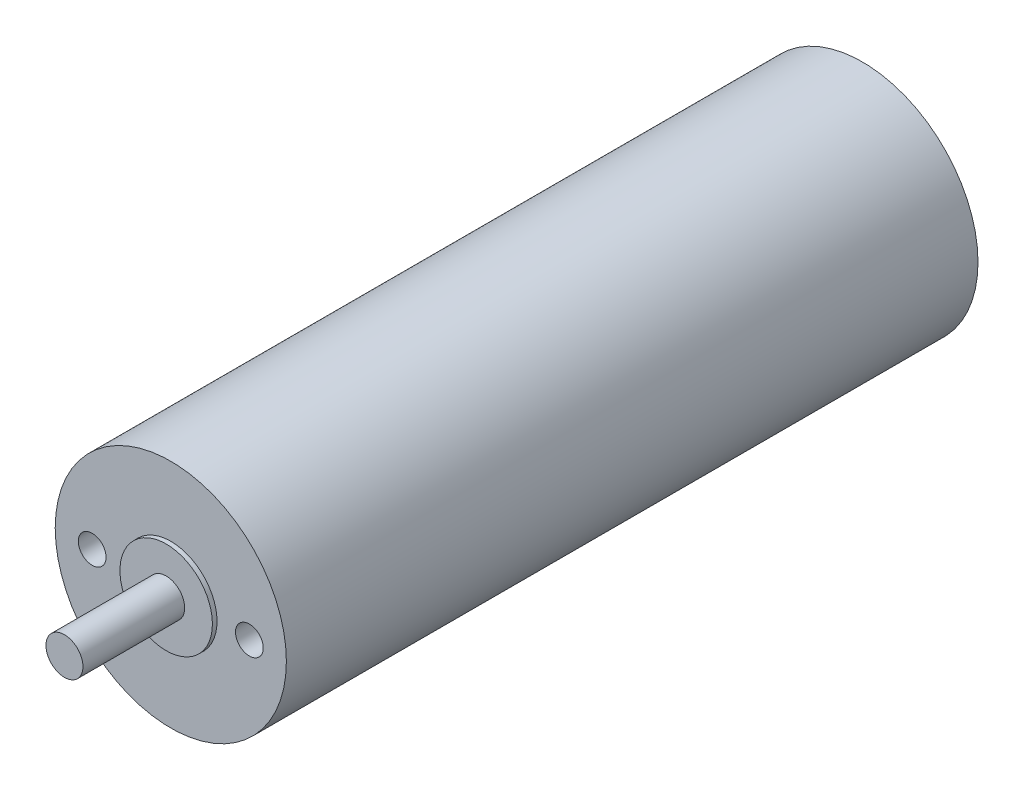
ISO-10303-21;
HEADER;
FILE_DESCRIPTION(('STEP AP214'),'2;1');
FILE_NAME('part.step','',(''),(''),'','','');
FILE_SCHEMA(('AUTOMOTIVE_DESIGN { 1 0 10303 214 1 1 1 1 }'));
ENDSEC;
DATA;
#1=APPLICATION_CONTEXT('core data for automotive mechanical design processes');
#2=APPLICATION_PROTOCOL_DEFINITION('international standard','automotive_design',2000,#1);
#3=PRODUCT_CONTEXT('',#1,'mechanical');
#4=PRODUCT('Part','Part','',(#3));
#5=PRODUCT_RELATED_PRODUCT_CATEGORY('part','',(#4));
#6=PRODUCT_DEFINITION_FORMATION('','',#4);
#7=PRODUCT_DEFINITION_CONTEXT('part definition',#1,'design');
#8=PRODUCT_DEFINITION('design','',#6,#7);
#9=PRODUCT_DEFINITION_SHAPE('','',#8);
#10=(LENGTH_UNIT() NAMED_UNIT(*) SI_UNIT(.MILLI.,.METRE.));
#11=(NAMED_UNIT(*) PLANE_ANGLE_UNIT() SI_UNIT($,.RADIAN.));
#12=(NAMED_UNIT(*) SI_UNIT($,.STERADIAN.) SOLID_ANGLE_UNIT());
#13=UNCERTAINTY_MEASURE_WITH_UNIT(LENGTH_MEASURE(1.E-05),#10,'distance_accuracy_value','');
#14=(GEOMETRIC_REPRESENTATION_CONTEXT(3) GLOBAL_UNCERTAINTY_ASSIGNED_CONTEXT((#13)) GLOBAL_UNIT_ASSIGNED_CONTEXT((#10,
#11,#12)) REPRESENTATION_CONTEXT('',''));
#15=CARTESIAN_POINT('',(0.,0.,0.));
#16=DIRECTION('',(0.,0.,1.));
#17=DIRECTION('',(1.,0.,0.));
#18=AXIS2_PLACEMENT_3D('',#15,#16,#17);
#19=CARTESIAN_POINT('',(0.,0.,74.8));
#20=DIRECTION('',(0.,0.,-1.));
#21=DIRECTION('',(-1.,0.,0.));
#22=AXIS2_PLACEMENT_3D('',#19,#20,#21);
#23=CYLINDRICAL_SURFACE('',#22,12.5);
#24=CARTESIAN_POINT('',(0.,0.,74.8));
#25=DIRECTION('',(0.,0.,1.));
#26=DIRECTION('',(1.,0.,0.));
#27=AXIS2_PLACEMENT_3D('',#24,#25,#26);
#28=CIRCLE('',#27,12.5);
#29=CARTESIAN_POINT('',(12.5,0.,74.8));
#30=VERTEX_POINT('',#29);
#31=EDGE_CURVE('E46',#30,#30,#28,.T.);
#32=ORIENTED_EDGE('',*,*,#31,.F.);
#33=EDGE_LOOP('',(#32));
#34=FACE_BOUND('',#33,.T.);
#35=CARTESIAN_POINT('',(0.,0.,0.));
#36=DIRECTION('',(0.,0.,1.));
#37=DIRECTION('',(1.,0.,0.));
#38=AXIS2_PLACEMENT_3D('',#35,#36,#37);
#39=CIRCLE('',#38,12.5);
#40=CARTESIAN_POINT('',(12.5,0.,0.));
#41=VERTEX_POINT('',#40);
#42=EDGE_CURVE('E37',#41,#41,#39,.T.);
#43=ORIENTED_EDGE('',*,*,#42,.T.);
#44=EDGE_LOOP('',(#43));
#45=FACE_BOUND('',#44,.T.);
#46=ADVANCED_FACE('F34',(#34,#45),#23,.T.);
#47=CARTESIAN_POINT('',(0.,0.,74.8));
#48=DIRECTION('',(0.,0.,1.));
#49=DIRECTION('',(1.,0.,0.));
#50=AXIS2_PLACEMENT_3D('',#47,#48,#49);
#51=PLANE('',#50);
#52=CARTESIAN_POINT('',(-8.5,0.,74.8));
#53=DIRECTION('',(0.,0.,1.));
#54=DIRECTION('',(1.,0.,0.));
#55=AXIS2_PLACEMENT_3D('',#52,#53,#54);
#56=CIRCLE('',#55,1.5);
#57=CARTESIAN_POINT('',(-7.,0.,74.8));
#58=VERTEX_POINT('',#57);
#59=EDGE_CURVE('E174',#58,#58,#56,.T.);
#60=ORIENTED_EDGE('',*,*,#59,.F.);
#61=EDGE_LOOP('',(#60));
#62=FACE_BOUND('',#61,.T.);
#63=CARTESIAN_POINT('',(8.5,0.,74.8));
#64=DIRECTION('',(0.,0.,1.));
#65=DIRECTION('',(1.,0.,0.));
#66=AXIS2_PLACEMENT_3D('',#63,#64,#65);
#67=CIRCLE('',#66,1.5);
#68=CARTESIAN_POINT('',(10.,0.,74.8));
#69=VERTEX_POINT('',#68);
#70=EDGE_CURVE('E182',#69,#69,#67,.T.);
#71=ORIENTED_EDGE('',*,*,#70,.F.);
#72=EDGE_LOOP('',(#71));
#73=FACE_BOUND('',#72,.T.);
#74=CARTESIAN_POINT('',(0.,0.,74.8));
#75=DIRECTION('',(0.,0.,1.));
#76=DIRECTION('',(1.,0.,0.));
#77=AXIS2_PLACEMENT_3D('',#74,#75,#76);
#78=CIRCLE('',#77,5.);
#79=CARTESIAN_POINT('',(5.,0.,74.8));
#80=VERTEX_POINT('',#79);
#81=EDGE_CURVE('E41',#80,#80,#78,.T.);
#82=ORIENTED_EDGE('',*,*,#81,.F.);
#83=EDGE_LOOP('',(#82));
#84=FACE_BOUND('',#83,.T.);
#85=ORIENTED_EDGE('',*,*,#31,.T.);
#86=EDGE_LOOP('',(#85));
#87=FACE_BOUND('',#86,.T.);
#88=ADVANCED_FACE('F64',(#62,#73,#84,#87),#51,.T.);
#89=CARTESIAN_POINT('',(0.,0.,0.));
#90=DIRECTION('',(0.,0.,1.));
#91=DIRECTION('',(1.,0.,0.));
#92=AXIS2_PLACEMENT_3D('',#89,#90,#91);
#93=PLANE('',#92);
#94=ORIENTED_EDGE('',*,*,#42,.F.);
#95=EDGE_LOOP('',(#94));
#96=FACE_BOUND('',#95,.T.);
#97=ADVANCED_FACE('F61',(#96),#93,.F.);
#98=CARTESIAN_POINT('',(0.,0.,75.3));
#99=DIRECTION('',(0.,0.,-1.));
#100=DIRECTION('',(-1.,0.,0.));
#101=AXIS2_PLACEMENT_3D('',#98,#99,#100);
#102=CYLINDRICAL_SURFACE('',#101,5.);
#103=CARTESIAN_POINT('',(0.,0.,75.3));
#104=DIRECTION('',(0.,0.,1.));
#105=DIRECTION('',(1.,0.,0.));
#106=AXIS2_PLACEMENT_3D('',#103,#104,#105);
#107=CIRCLE('',#106,5.);
#108=CARTESIAN_POINT('',(5.,0.,75.3));
#109=VERTEX_POINT('',#108);
#110=EDGE_CURVE('E52',#109,#109,#107,.T.);
#111=ORIENTED_EDGE('',*,*,#110,.F.);
#112=EDGE_LOOP('',(#111));
#113=FACE_BOUND('',#112,.T.);
#114=ORIENTED_EDGE('',*,*,#81,.T.);
#115=EDGE_LOOP('',(#114));
#116=FACE_BOUND('',#115,.T.);
#117=ADVANCED_FACE('F63',(#113,#116),#102,.T.);
#118=CARTESIAN_POINT('',(0.,0.,75.3));
#119=DIRECTION('',(0.,0.,1.));
#120=DIRECTION('',(1.,0.,0.));
#121=AXIS2_PLACEMENT_3D('',#118,#119,#120);
#122=PLANE('',#121);
#123=CARTESIAN_POINT('',(0.,0.,75.3));
#124=DIRECTION('',(0.,0.,1.));
#125=DIRECTION('',(1.,0.,0.));
#126=AXIS2_PLACEMENT_3D('',#123,#124,#125);
#127=CIRCLE('',#126,2.);
#128=CARTESIAN_POINT('',(2.,0.,75.3));
#129=VERTEX_POINT('',#128);
#130=EDGE_CURVE('E10',#129,#129,#127,.T.);
#131=ORIENTED_EDGE('',*,*,#130,.F.);
#132=EDGE_LOOP('',(#131));
#133=FACE_BOUND('',#132,.T.);
#134=ORIENTED_EDGE('',*,*,#110,.T.);
#135=EDGE_LOOP('',(#134));
#136=FACE_BOUND('',#135,.T.);
#137=ADVANCED_FACE('F69',(#133,#136),#122,.T.);
#138=CARTESIAN_POINT('',(0.,0.,86.3));
#139=DIRECTION('',(0.,0.,-1.));
#140=DIRECTION('',(-1.,0.,0.));
#141=AXIS2_PLACEMENT_3D('',#138,#139,#140);
#142=CYLINDRICAL_SURFACE('',#141,2.);
#143=CARTESIAN_POINT('',(0.,0.,86.3));
#144=DIRECTION('',(0.,0.,1.));
#145=DIRECTION('',(1.,0.,0.));
#146=AXIS2_PLACEMENT_3D('',#143,#144,#145);
#147=CIRCLE('',#146,2.);
#148=CARTESIAN_POINT('',(2.,0.,86.3));
#149=VERTEX_POINT('',#148);
#150=EDGE_CURVE('E50',#149,#149,#147,.T.);
#151=ORIENTED_EDGE('',*,*,#150,.F.);
#152=EDGE_LOOP('',(#151));
#153=FACE_BOUND('',#152,.T.);
#154=ORIENTED_EDGE('',*,*,#130,.T.);
#155=EDGE_LOOP('',(#154));
#156=FACE_BOUND('',#155,.T.);
#157=ADVANCED_FACE('F136',(#153,#156),#142,.T.);
#158=CARTESIAN_POINT('',(0.,0.,86.3));
#159=DIRECTION('',(0.,0.,1.));
#160=DIRECTION('',(1.,0.,0.));
#161=AXIS2_PLACEMENT_3D('',#158,#159,#160);
#162=PLANE('',#161);
#163=ORIENTED_EDGE('',*,*,#150,.T.);
#164=EDGE_LOOP('',(#163));
#165=FACE_BOUND('',#164,.T.);
#166=ADVANCED_FACE('F89',(#165),#162,.T.);
#167=CARTESIAN_POINT('',(8.5,0.,70.8));
#168=DIRECTION('',(0.,0.,1.));
#169=DIRECTION('',(1.,0.,0.));
#170=AXIS2_PLACEMENT_3D('',#167,#168,#169);
#171=CYLINDRICAL_SURFACE('',#170,1.5);
#172=CARTESIAN_POINT('',(8.5,0.,70.8));
#173=DIRECTION('',(0.,0.,1.));
#174=DIRECTION('',(1.,0.,0.));
#175=AXIS2_PLACEMENT_3D('',#172,#173,#174);
#176=CIRCLE('',#175,1.5);
#177=CARTESIAN_POINT('',(10.,0.,70.8));
#178=VERTEX_POINT('',#177);
#179=EDGE_CURVE('E178',#178,#178,#176,.T.);
#180=ORIENTED_EDGE('',*,*,#179,.F.);
#181=EDGE_LOOP('',(#180));
#182=FACE_BOUND('',#181,.T.);
#183=ORIENTED_EDGE('',*,*,#70,.T.);
#184=EDGE_LOOP('',(#183));
#185=FACE_BOUND('',#184,.T.);
#186=ADVANCED_FACE('F94',(#182,#185),#171,.F.);
#187=CARTESIAN_POINT('',(8.5,0.,70.8));
#188=DIRECTION('',(0.,0.,1.));
#189=DIRECTION('',(1.,0.,0.));
#190=AXIS2_PLACEMENT_3D('',#187,#188,#189);
#191=PLANE('',#190);
#192=ORIENTED_EDGE('',*,*,#179,.T.);
#193=EDGE_LOOP('',(#192));
#194=FACE_BOUND('',#193,.T.);
#195=ADVANCED_FACE('F99',(#194),#191,.T.);
#196=CARTESIAN_POINT('',(-8.5,0.,70.8));
#197=DIRECTION('',(0.,0.,1.));
#198=DIRECTION('',(1.,0.,0.));
#199=AXIS2_PLACEMENT_3D('',#196,#197,#198);
#200=CYLINDRICAL_SURFACE('',#199,1.5);
#201=CARTESIAN_POINT('',(-8.5,0.,70.8));
#202=DIRECTION('',(0.,0.,1.));
#203=DIRECTION('',(1.,0.,0.));
#204=AXIS2_PLACEMENT_3D('',#201,#202,#203);
#205=CIRCLE('',#204,1.5);
#206=CARTESIAN_POINT('',(-7.,0.,70.8));
#207=VERTEX_POINT('',#206);
#208=EDGE_CURVE('E173',#207,#207,#205,.T.);
#209=ORIENTED_EDGE('',*,*,#208,.F.);
#210=EDGE_LOOP('',(#209));
#211=FACE_BOUND('',#210,.T.);
#212=ORIENTED_EDGE('',*,*,#59,.T.);
#213=EDGE_LOOP('',(#212));
#214=FACE_BOUND('',#213,.T.);
#215=ADVANCED_FACE('F109',(#211,#214),#200,.F.);
#216=CARTESIAN_POINT('',(-8.5,0.,70.8));
#217=DIRECTION('',(0.,0.,1.));
#218=DIRECTION('',(1.,0.,0.));
#219=AXIS2_PLACEMENT_3D('',#216,#217,#218);
#220=PLANE('',#219);
#221=ORIENTED_EDGE('',*,*,#208,.T.);
#222=EDGE_LOOP('',(#221));
#223=FACE_BOUND('',#222,.T.);
#224=ADVANCED_FACE('F119',(#223),#220,.T.);
#225=CLOSED_SHELL('',(#46,#88,#97,#117,#137,#157,#166,#186,#195,#215,#224));
#226=MANIFOLD_SOLID_BREP('B2',#225);
#227=ADVANCED_BREP_SHAPE_REPRESENTATION('',(#18,#226),#14);
#228=SHAPE_DEFINITION_REPRESENTATION(#9,#227);
ENDSEC;
END-ISO-10303-21;
